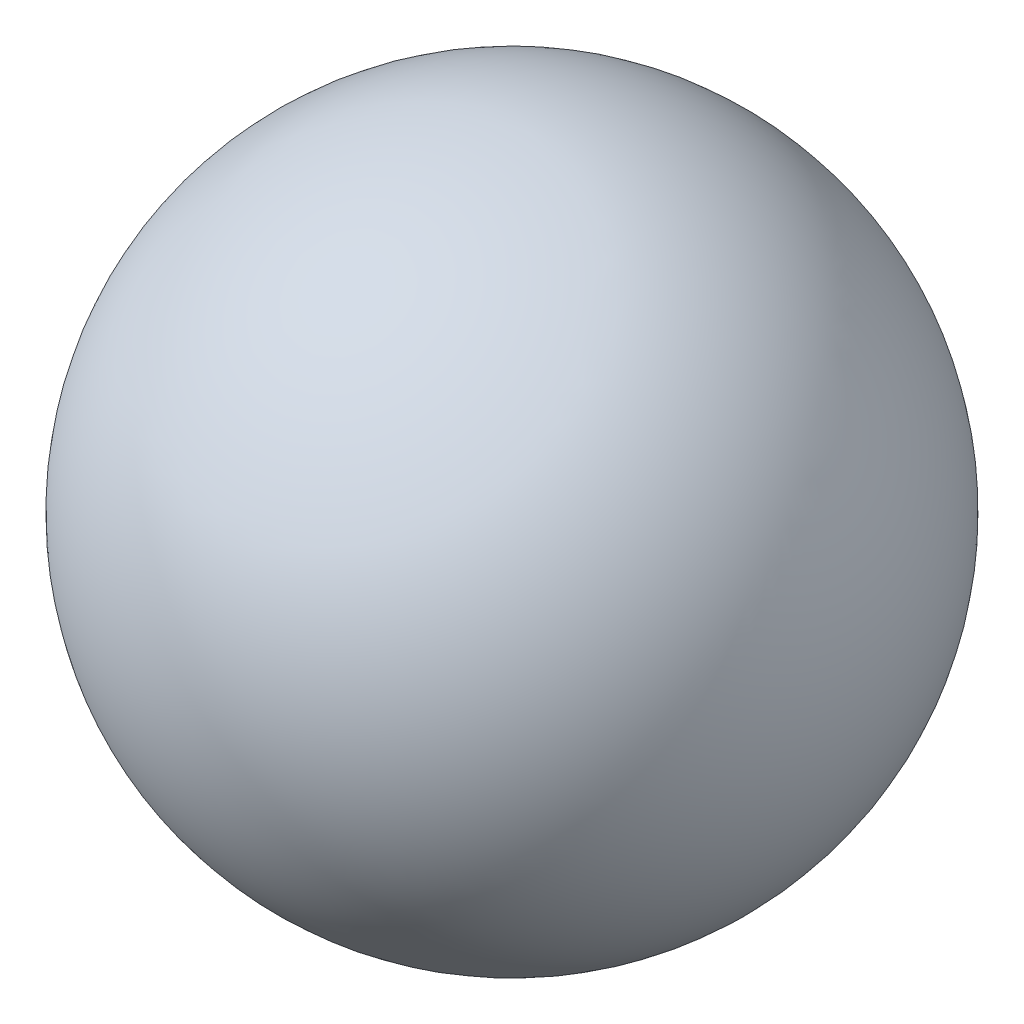
ISO-10303-21;
HEADER;
FILE_DESCRIPTION(('STEP AP214'),'2;1');
FILE_NAME('part.step','',(''),(''),'','','');
FILE_SCHEMA(('AUTOMOTIVE_DESIGN { 1 0 10303 214 1 1 1 1 }'));
ENDSEC;
DATA;
#1=APPLICATION_CONTEXT('core data for automotive mechanical design processes');
#2=APPLICATION_PROTOCOL_DEFINITION('international standard','automotive_design',2000,#1);
#3=PRODUCT_CONTEXT('',#1,'mechanical');
#4=PRODUCT('Part','Part','',(#3));
#5=PRODUCT_RELATED_PRODUCT_CATEGORY('part','',(#4));
#6=PRODUCT_DEFINITION_FORMATION('','',#4);
#7=PRODUCT_DEFINITION_CONTEXT('part definition',#1,'design');
#8=PRODUCT_DEFINITION('design','',#6,#7);
#9=PRODUCT_DEFINITION_SHAPE('','',#8);
#10=(LENGTH_UNIT() NAMED_UNIT(*) SI_UNIT(.MILLI.,.METRE.));
#11=(NAMED_UNIT(*) PLANE_ANGLE_UNIT() SI_UNIT($,.RADIAN.));
#12=(NAMED_UNIT(*) SI_UNIT($,.STERADIAN.) SOLID_ANGLE_UNIT());
#13=UNCERTAINTY_MEASURE_WITH_UNIT(LENGTH_MEASURE(1.E-05),#10,'distance_accuracy_value','');
#14=(GEOMETRIC_REPRESENTATION_CONTEXT(3) GLOBAL_UNCERTAINTY_ASSIGNED_CONTEXT((#13)) GLOBAL_UNIT_ASSIGNED_CONTEXT((#10,
#11,#12)) REPRESENTATION_CONTEXT('',''));
#15=CARTESIAN_POINT('',(0.,0.,0.));
#16=DIRECTION('',(0.,0.,1.));
#17=DIRECTION('',(1.,0.,0.));
#18=AXIS2_PLACEMENT_3D('',#15,#16,#17);
#19=CARTESIAN_POINT('',(0.,0.,0.));
#20=DIRECTION('',(0.689278185613315,0.724496779038814,0.));
#21=DIRECTION('',(0.724496779038814,-0.689278185613315,0.));
#22=AXIS2_PLACEMENT_3D('',#19,#20,#21);
#23=SPHERICAL_SURFACE('',#22,76.2);
#24=CARTESIAN_POINT('',(52.5229977437346,55.2066545627576,0.));
#25=VERTEX_POINT('',#24);
#26=VERTEX_LOOP('',#25);
#27=FACE_BOUND('',#26,.T.);
#28=ADVANCED_FACE('F30',(#27),#23,.T.);
#29=CLOSED_SHELL('',(#28));
#30=MANIFOLD_SOLID_BREP('B2',#29);
#31=ADVANCED_BREP_SHAPE_REPRESENTATION('',(#18,#30),#14);
#32=SHAPE_DEFINITION_REPRESENTATION(#9,#31);
ENDSEC;
END-ISO-10303-21;
